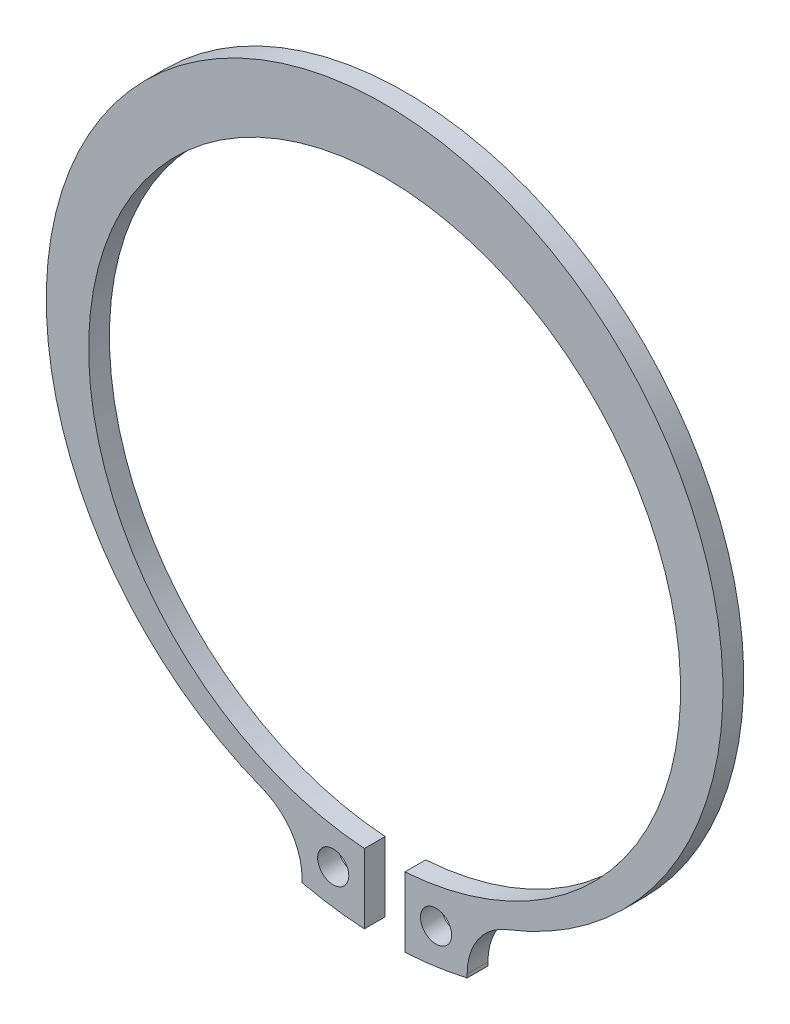
ISO-10303-21;
HEADER;
FILE_DESCRIPTION(('STEP AP214'),'2;1');
FILE_NAME('part.step','',(''),(''),'','','');
FILE_SCHEMA(('AUTOMOTIVE_DESIGN { 1 0 10303 214 1 1 1 1 }'));
ENDSEC;
DATA;
#1=APPLICATION_CONTEXT('core data for automotive mechanical design processes');
#2=APPLICATION_PROTOCOL_DEFINITION('international standard','automotive_design',2000,#1);
#3=PRODUCT_CONTEXT('',#1,'mechanical');
#4=PRODUCT('Part','Part','',(#3));
#5=PRODUCT_RELATED_PRODUCT_CATEGORY('part','',(#4));
#6=PRODUCT_DEFINITION_FORMATION('','',#4);
#7=PRODUCT_DEFINITION_CONTEXT('part definition',#1,'design');
#8=PRODUCT_DEFINITION('design','',#6,#7);
#9=PRODUCT_DEFINITION_SHAPE('','',#8);
#10=(LENGTH_UNIT() NAMED_UNIT(*) SI_UNIT(.MILLI.,.METRE.));
#11=(NAMED_UNIT(*) PLANE_ANGLE_UNIT() SI_UNIT($,.RADIAN.));
#12=(NAMED_UNIT(*) SI_UNIT($,.STERADIAN.) SOLID_ANGLE_UNIT());
#13=UNCERTAINTY_MEASURE_WITH_UNIT(LENGTH_MEASURE(1.E-05),#10,'distance_accuracy_value','');
#14=(GEOMETRIC_REPRESENTATION_CONTEXT(3) GLOBAL_UNCERTAINTY_ASSIGNED_CONTEXT((#13)) GLOBAL_UNIT_ASSIGNED_CONTEXT((#10,
#11,#12)) REPRESENTATION_CONTEXT('',''));
#15=CARTESIAN_POINT('',(0.,0.,0.));
#16=DIRECTION('',(0.,0.,1.));
#17=DIRECTION('',(1.,0.,0.));
#18=AXIS2_PLACEMENT_3D('',#15,#16,#17);
#19=CARTESIAN_POINT('',(9.90000000000002,-5.85070601970945,0.));
#20=DIRECTION('',(1.00000000000002,0.,0.));
#21=DIRECTION('',(0.,0.,-1.));
#22=AXIS2_PLACEMENT_3D('',#19,#20,#21);
#23=PLANE('',#22);
#24=DIRECTION('',(0.,0.,1.));
#25=VECTOR('',#24,1.);
#26=CARTESIAN_POINT('',(9.89999999998936,-5.85070601966375,0.));
#27=LINE('',#26,#25);
#28=CARTESIAN_POINT('',(9.89999999999469,-5.85070601966253,0.));
#29=VERTEX_POINT('',#28);
#30=CARTESIAN_POINT('',(9.89999999999469,-5.85070601966253,2.));
#31=VERTEX_POINT('',#30);
#32=EDGE_CURVE('E95',#29,#31,#27,.T.);
#33=ORIENTED_EDGE('',*,*,#32,.F.);
#34=DIRECTION('',(0.,1.00000000000002,0.));
#35=VECTOR('',#34,1.);
#36=CARTESIAN_POINT('',(9.90000000000002,4.44089209850063E-13,0.));
#37=LINE('',#36,#35);
#38=CARTESIAN_POINT('',(9.90000000000002,-5.49641347022945,0.));
#39=VERTEX_POINT('',#38);
#40=EDGE_CURVE('E98',#29,#39,#37,.T.);
#41=ORIENTED_EDGE('',*,*,#40,.T.);
#42=DIRECTION('',(0.,0.,1.));
#43=VECTOR('',#42,1.);
#44=CARTESIAN_POINT('',(9.90000000000002,-5.49641347022945,0.));
#45=LINE('',#44,#43);
#46=CARTESIAN_POINT('',(9.90000000000002,-5.49641347022945,2.));
#47=VERTEX_POINT('',#46);
#48=EDGE_CURVE('E118',#39,#47,#45,.T.);
#49=ORIENTED_EDGE('',*,*,#48,.T.);
#50=DIRECTION('',(0.,1.00000000000002,0.));
#51=VECTOR('',#50,1.);
#52=CARTESIAN_POINT('',(9.90000000000002,-5.85070601970945,2.));
#53=LINE('',#52,#51);
#54=EDGE_CURVE('E100',#47,#31,#53,.F.);
#55=ORIENTED_EDGE('',*,*,#54,.T.);
#56=EDGE_LOOP('',(#33,#41,#49,#55));
#57=FACE_BOUND('',#56,.T.);
#58=ADVANCED_FACE('F16',(#57),#23,.T.);
#59=CARTESIAN_POINT('',(-6.00000000000001,-5.49641347022953,0.));
#60=DIRECTION('',(-1.00000000000002,0.,0.));
#61=DIRECTION('',(0.,0.,1.));
#62=AXIS2_PLACEMENT_3D('',#59,#60,#61);
#63=PLANE('',#62);
#64=DIRECTION('',(0.,0.,1.));
#65=VECTOR('',#64,1.);
#66=CARTESIAN_POINT('',(-6.00000000000001,-5.49641347022953,0.));
#67=LINE('',#66,#65);
#68=CARTESIAN_POINT('',(-6.00000000000001,-5.49641347022953,2.));
#69=VERTEX_POINT('',#68);
#70=CARTESIAN_POINT('',(-6.00000000000001,-5.49641347022953,0.));
#71=VERTEX_POINT('',#70);
#72=EDGE_CURVE('E174',#69,#71,#67,.F.);
#73=ORIENTED_EDGE('',*,*,#72,.T.);
#74=DIRECTION('',(0.,1.00000000000002,0.));
#75=VECTOR('',#74,1.);
#76=CARTESIAN_POINT('',(-6.00000000000001,0.,0.));
#77=LINE('',#76,#75);
#78=CARTESIAN_POINT('',(-5.99999999999468,-5.85070601966261,0.));
#79=VERTEX_POINT('',#78);
#80=EDGE_CURVE('E114',#71,#79,#77,.F.);
#81=ORIENTED_EDGE('',*,*,#80,.T.);
#82=DIRECTION('',(0.,0.,1.));
#83=VECTOR('',#82,1.);
#84=CARTESIAN_POINT('',(-5.99999999998946,-5.85070601966383,0.));
#85=LINE('',#84,#83);
#86=CARTESIAN_POINT('',(-5.99999999999468,-5.85070601966261,2.));
#87=VERTEX_POINT('',#86);
#88=EDGE_CURVE('E161',#87,#79,#85,.F.);
#89=ORIENTED_EDGE('',*,*,#88,.F.);
#90=DIRECTION('',(0.,1.00000000000002,0.));
#91=VECTOR('',#90,1.);
#92=CARTESIAN_POINT('',(-6.00000000000001,-5.49641347022953,2.));
#93=LINE('',#92,#91);
#94=EDGE_CURVE('E115',#87,#69,#93,.T.);
#95=ORIENTED_EDGE('',*,*,#94,.T.);
#96=EDGE_LOOP('',(#73,#81,#89,#95));
#97=FACE_BOUND('',#96,.T.);
#98=ADVANCED_FACE('F210',(#97),#63,.T.);
#99=CARTESIAN_POINT('',(0.,0.,0.));
#100=DIRECTION('',(0.,0.,1.));
#101=DIRECTION('',(1.00000000000002,0.,0.));
#102=AXIS2_PLACEMENT_3D('',#99,#100,#101);
#103=PLANE('',#102);
#104=CARTESIAN_POINT('',(6.90000000000002,-3.02654355575956,0.));
#105=DIRECTION('',(0.,0.,-1.));
#106=DIRECTION('',(-1.00000000000002,0.,0.));
#107=AXIS2_PLACEMENT_3D('',#104,#105,#106);
#108=CIRCLE('',#107,1.5);
#109=CARTESIAN_POINT('',(5.39999999999998,-3.02654355575956,0.));
#110=VERTEX_POINT('',#109);
#111=EDGE_CURVE('E151',#110,#110,#108,.F.);
#112=ORIENTED_EDGE('',*,*,#111,.T.);
#113=EDGE_LOOP('',(#112));
#114=FACE_BOUND('',#113,.T.);
#115=CARTESIAN_POINT('',(-3.,-3.02654355576,0.));
#116=DIRECTION('',(0.,0.,1.));
#117=DIRECTION('',(1.00000000000002,0.,0.));
#118=AXIS2_PLACEMENT_3D('',#115,#116,#117);
#119=CIRCLE('',#118,1.5);
#120=CARTESIAN_POINT('',(-1.49999999999997,-3.02654355576,0.));
#121=VERTEX_POINT('',#120);
#122=EDGE_CURVE('E154',#121,#121,#119,.T.);
#123=ORIENTED_EDGE('',*,*,#122,.T.);
#124=EDGE_LOOP('',(#123));
#125=FACE_BOUND('',#124,.T.);
#126=CARTESIAN_POINT('',(1.95000000000001,28.4332112151011,0.));
#127=DIRECTION('',(0.,0.,1.));
#128=DIRECTION('',(1.00000000000002,0.,0.));
#129=AXIS2_PLACEMENT_3D('',#126,#127,#128);
#130=CIRCLE('',#129,35.1936);
#131=CARTESIAN_POINT('',(0.,-6.70632465208856,0.));
#132=VERTEX_POINT('',#131);
#133=EDGE_CURVE('E159',#79,#132,#130,.T.);
#134=ORIENTED_EDGE('',*,*,#133,.F.);
#135=ORIENTED_EDGE('',*,*,#80,.F.);
#136=CARTESIAN_POINT('',(-12.,-5.49641347022957,0.));
#137=DIRECTION('',(0.,0.,1.));
#138=DIRECTION('',(1.00000000000002,0.,0.));
#139=AXIS2_PLACEMENT_3D('',#136,#137,#138);
#140=CIRCLE('',#139,6.);
#141=CARTESIAN_POINT('',(-9.83048211508952,0.097618362630239,0.));
#142=VERTEX_POINT('',#141);
#143=EDGE_CURVE('E162',#71,#142,#140,.T.);
#144=ORIENTED_EDGE('',*,*,#143,.T.);
#145=CARTESIAN_POINT('',(1.95000000000001,30.4732112151011,0.));
#146=DIRECTION('',(0.,0.,1.));
#147=DIRECTION('',(1.00000000000002,0.,0.));
#148=AXIS2_PLACEMENT_3D('',#145,#146,#147);
#149=CIRCLE('',#148,32.58);
#150=CARTESIAN_POINT('',(13.7304821150858,0.0976183626536092,0.));
#151=VERTEX_POINT('',#150);
#152=EDGE_CURVE('E165',#151,#142,#149,.T.);
#153=ORIENTED_EDGE('',*,*,#152,.F.);
#154=CARTESIAN_POINT('',(15.9,-5.4964134702296,0.));
#155=DIRECTION('',(0.,0.,1.));
#156=DIRECTION('',(1.00000000000002,0.,0.));
#157=AXIS2_PLACEMENT_3D('',#154,#155,#156);
#158=CIRCLE('',#157,6.);
#159=EDGE_CURVE('E112',#151,#39,#158,.T.);
#160=ORIENTED_EDGE('',*,*,#159,.T.);
#161=ORIENTED_EDGE('',*,*,#40,.F.);
#162=CARTESIAN_POINT('',(1.95000000000001,28.4332112151011,0.));
#163=DIRECTION('',(0.,0.,1.));
#164=DIRECTION('',(1.00000000000002,0.,0.));
#165=AXIS2_PLACEMENT_3D('',#162,#163,#164);
#166=CIRCLE('',#165,35.1936);
#167=CARTESIAN_POINT('',(3.89999999999879,-6.70632465206772,0.));
#168=VERTEX_POINT('',#167);
#169=EDGE_CURVE('E19',#168,#29,#166,.T.);
#170=ORIENTED_EDGE('',*,*,#169,.F.);
#171=DIRECTION('',(0.,1.00000000000002,0.));
#172=VECTOR('',#171,1.);
#173=CARTESIAN_POINT('',(3.90000000000001,4.44089209850063E-13,0.));
#174=LINE('',#173,#172);
#175=CARTESIAN_POINT('',(3.89999999999846,4.41036096532343E-11,0.));
#176=VERTEX_POINT('',#175);
#177=EDGE_CURVE('E90',#176,#168,#174,.F.);
#178=ORIENTED_EDGE('',*,*,#177,.F.);
#179=CARTESIAN_POINT('',(1.95000000000001,28.4332112151011,0.));
#180=DIRECTION('',(0.,0.,1.));
#181=DIRECTION('',(1.00000000000002,0.,0.));
#182=AXIS2_PLACEMENT_3D('',#179,#180,#181);
#183=CIRCLE('',#182,28.5);
#184=CARTESIAN_POINT('',(1.4432899320127E-12,4.36595204433843E-11,0.));
#185=VERTEX_POINT('',#184);
#186=EDGE_CURVE('E126',#176,#185,#183,.T.);
#187=ORIENTED_EDGE('',*,*,#186,.T.);
#188=DIRECTION('',(0.,1.00000000000002,0.));
#189=VECTOR('',#188,1.);
#190=CARTESIAN_POINT('',(0.,-6.70632465210946,0.));
#191=LINE('',#190,#189);
#192=EDGE_CURVE('E124',#132,#185,#191,.T.);
#193=ORIENTED_EDGE('',*,*,#192,.F.);
#194=EDGE_LOOP('',(#134,#135,#144,#153,#160,#161,#170,#178,#187,#193));
#195=FACE_BOUND('',#194,.T.);
#196=ADVANCED_FACE('F109',(#114,#125,#195),#103,.F.);
#197=CARTESIAN_POINT('',(3.90000000000001,4.44089209850063E-13,0.));
#198=DIRECTION('',(-1.00000000000002,0.,0.));
#199=DIRECTION('',(0.,0.,1.));
#200=AXIS2_PLACEMENT_3D('',#197,#198,#199);
#201=PLANE('',#200);
#202=DIRECTION('',(0.,0.,1.));
#203=VECTOR('',#202,1.);
#204=CARTESIAN_POINT('',(3.89999999999702,4.39925873507718E-11,0.));
#205=LINE('',#204,#203);
#206=CARTESIAN_POINT('',(3.89999999999846,4.41036096532343E-11,2.));
#207=VERTEX_POINT('',#206);
#208=EDGE_CURVE('E157',#207,#176,#205,.F.);
#209=ORIENTED_EDGE('',*,*,#208,.T.);
#210=ORIENTED_EDGE('',*,*,#177,.T.);
#211=DIRECTION('',(0.,0.,1.));
#212=VECTOR('',#211,1.);
#213=CARTESIAN_POINT('',(3.89999999999768,-6.70632465206778,0.));
#214=LINE('',#213,#212);
#215=CARTESIAN_POINT('',(3.89999999999879,-6.70632465206772,2.));
#216=VERTEX_POINT('',#215);
#217=EDGE_CURVE('E105',#216,#168,#214,.F.);
#218=ORIENTED_EDGE('',*,*,#217,.F.);
#219=DIRECTION('',(0.,1.00000000000002,0.));
#220=VECTOR('',#219,1.);
#221=CARTESIAN_POINT('',(3.90000000000001,4.44089209850063E-13,2.));
#222=LINE('',#221,#220);
#223=EDGE_CURVE('E150',#207,#216,#222,.F.);
#224=ORIENTED_EDGE('',*,*,#223,.F.);
#225=EDGE_LOOP('',(#209,#210,#218,#224));
#226=FACE_BOUND('',#225,.T.);
#227=ADVANCED_FACE('F199',(#226),#201,.T.);
#228=CARTESIAN_POINT('',(1.95000000000001,28.4332112151011,0.));
#229=DIRECTION('',(0.,0.,1.));
#230=DIRECTION('',(1.00000000000002,0.,0.));
#231=AXIS2_PLACEMENT_3D('',#228,#229,#230);
#232=CYLINDRICAL_SURFACE('',#231,35.1936);
#233=ORIENTED_EDGE('',*,*,#217,.T.);
#234=ORIENTED_EDGE('',*,*,#169,.T.);
#235=ORIENTED_EDGE('',*,*,#32,.T.);
#236=CARTESIAN_POINT('',(1.95000000000001,28.4332112151011,2.));
#237=DIRECTION('',(0.,0.,1.));
#238=DIRECTION('',(1.00000000000002,0.,0.));
#239=AXIS2_PLACEMENT_3D('',#236,#237,#238);
#240=CIRCLE('',#239,35.1936);
#241=EDGE_CURVE('E148',#216,#31,#240,.T.);
#242=ORIENTED_EDGE('',*,*,#241,.F.);
#243=EDGE_LOOP('',(#233,#234,#235,#242));
#244=FACE_BOUND('',#243,.T.);
#245=ADVANCED_FACE('F117',(#244),#232,.T.);
#246=CARTESIAN_POINT('',(15.9,-5.4964134702296,0.));
#247=DIRECTION('',(0.,0.,1.));
#248=DIRECTION('',(1.00000000000002,0.,0.));
#249=AXIS2_PLACEMENT_3D('',#246,#247,#248);
#250=CYLINDRICAL_SURFACE('',#249,6.);
#251=CARTESIAN_POINT('',(15.9,-5.4964134702296,2.));
#252=DIRECTION('',(0.,0.,1.));
#253=DIRECTION('',(1.00000000000002,0.,0.));
#254=AXIS2_PLACEMENT_3D('',#251,#252,#253);
#255=CIRCLE('',#254,6.);
#256=CARTESIAN_POINT('',(13.7304821150775,0.097618362674759,2.));
#257=VERTEX_POINT('',#256);
#258=EDGE_CURVE('E145',#47,#257,#255,.F.);
#259=ORIENTED_EDGE('',*,*,#258,.F.);
#260=ORIENTED_EDGE('',*,*,#48,.F.);
#261=ORIENTED_EDGE('',*,*,#159,.F.);
#262=DIRECTION('',(0.,0.,1.));
#263=VECTOR('',#262,1.);
#264=CARTESIAN_POINT('',(13.7304821150833,0.0976183626770211,0.));
#265=LINE('',#264,#263);
#266=EDGE_CURVE('E167',#257,#151,#265,.F.);
#267=ORIENTED_EDGE('',*,*,#266,.F.);
#268=EDGE_LOOP('',(#259,#260,#261,#267));
#269=FACE_BOUND('',#268,.T.);
#270=ADVANCED_FACE('F202',(#269),#250,.F.);
#271=CARTESIAN_POINT('',(1.95000000000001,30.4732112151011,0.));
#272=DIRECTION('',(0.,0.,1.));
#273=DIRECTION('',(1.00000000000002,0.,0.));
#274=AXIS2_PLACEMENT_3D('',#271,#272,#273);
#275=CYLINDRICAL_SURFACE('',#274,32.58);
#276=ORIENTED_EDGE('',*,*,#266,.T.);
#277=ORIENTED_EDGE('',*,*,#152,.T.);
#278=DIRECTION('',(0.,0.,1.));
#279=VECTOR('',#278,1.);
#280=CARTESIAN_POINT('',(-9.83048211509108,0.0976183626308219,0.));
#281=LINE('',#280,#279);
#282=CARTESIAN_POINT('',(-9.83048211508952,0.097618362630239,2.));
#283=VERTEX_POINT('',#282);
#284=EDGE_CURVE('E164',#142,#283,#281,.T.);
#285=ORIENTED_EDGE('',*,*,#284,.T.);
#286=CARTESIAN_POINT('',(1.95000000000001,30.4732112151011,2.));
#287=DIRECTION('',(0.,0.,1.));
#288=DIRECTION('',(1.00000000000002,0.,0.));
#289=AXIS2_PLACEMENT_3D('',#286,#287,#288);
#290=CIRCLE('',#289,32.58);
#291=EDGE_CURVE('E142',#257,#283,#290,.T.);
#292=ORIENTED_EDGE('',*,*,#291,.F.);
#293=EDGE_LOOP('',(#276,#277,#285,#292));
#294=FACE_BOUND('',#293,.T.);
#295=ADVANCED_FACE('F203',(#294),#275,.T.);
#296=CARTESIAN_POINT('',(-12.,-5.49641347022957,0.));
#297=DIRECTION('',(0.,0.,1.));
#298=DIRECTION('',(1.00000000000002,0.,0.));
#299=AXIS2_PLACEMENT_3D('',#296,#297,#298);
#300=CYLINDRICAL_SURFACE('',#299,6.);
#301=CARTESIAN_POINT('',(-12.,-5.49641347022957,2.));
#302=DIRECTION('',(0.,0.,1.));
#303=DIRECTION('',(1.00000000000002,0.,0.));
#304=AXIS2_PLACEMENT_3D('',#301,#302,#303);
#305=CIRCLE('',#304,6.);
#306=EDGE_CURVE('E139',#283,#69,#305,.F.);
#307=ORIENTED_EDGE('',*,*,#306,.F.);
#308=ORIENTED_EDGE('',*,*,#284,.F.);
#309=ORIENTED_EDGE('',*,*,#143,.F.);
#310=ORIENTED_EDGE('',*,*,#72,.F.);
#311=EDGE_LOOP('',(#307,#308,#309,#310));
#312=FACE_BOUND('',#311,.T.);
#313=ADVANCED_FACE('F207',(#312),#300,.F.);
#314=CARTESIAN_POINT('',(1.95000000000001,28.4332112151011,0.));
#315=DIRECTION('',(0.,0.,1.));
#316=DIRECTION('',(1.00000000000002,0.,0.));
#317=AXIS2_PLACEMENT_3D('',#314,#315,#316);
#318=CYLINDRICAL_SURFACE('',#317,35.1936);
#319=ORIENTED_EDGE('',*,*,#88,.T.);
#320=ORIENTED_EDGE('',*,*,#133,.T.);
#321=DIRECTION('',(0.,0.,-1.));
#322=VECTOR('',#321,1.);
#323=CARTESIAN_POINT('',(0.,-6.70632465210946,0.));
#324=LINE('',#323,#322);
#325=CARTESIAN_POINT('',(0.,-6.70632465208856,2.));
#326=VERTEX_POINT('',#325);
#327=EDGE_CURVE('E127',#326,#132,#324,.T.);
#328=ORIENTED_EDGE('',*,*,#327,.F.);
#329=CARTESIAN_POINT('',(1.95000000000001,28.4332112151011,2.));
#330=DIRECTION('',(0.,0.,1.));
#331=DIRECTION('',(1.00000000000002,0.,0.));
#332=AXIS2_PLACEMENT_3D('',#329,#330,#331);
#333=CIRCLE('',#332,35.1936);
#334=EDGE_CURVE('E136',#87,#326,#333,.T.);
#335=ORIENTED_EDGE('',*,*,#334,.F.);
#336=EDGE_LOOP('',(#319,#320,#328,#335));
#337=FACE_BOUND('',#336,.T.);
#338=ADVANCED_FACE('F193',(#337),#318,.T.);
#339=CARTESIAN_POINT('',(0.,-6.70632465210946,0.));
#340=DIRECTION('',(1.00000000000002,0.,0.));
#341=DIRECTION('',(0.,0.,-1.));
#342=AXIS2_PLACEMENT_3D('',#339,#340,#341);
#343=PLANE('',#342);
#344=ORIENTED_EDGE('',*,*,#327,.T.);
#345=ORIENTED_EDGE('',*,*,#192,.T.);
#346=DIRECTION('',(0.,0.,1.));
#347=VECTOR('',#346,1.);
#348=CARTESIAN_POINT('',(2.99760216648792E-12,4.35484981409218E-11,0.));
#349=LINE('',#348,#347);
#350=CARTESIAN_POINT('',(1.4432899320127E-12,4.36595204433843E-11,2.));
#351=VERTEX_POINT('',#350);
#352=EDGE_CURVE('E34',#185,#351,#349,.T.);
#353=ORIENTED_EDGE('',*,*,#352,.T.);
#354=DIRECTION('',(0.,1.00000000000002,0.));
#355=VECTOR('',#354,1.);
#356=CARTESIAN_POINT('',(0.,0.,2.));
#357=LINE('',#356,#355);
#358=EDGE_CURVE('E135',#326,#351,#357,.T.);
#359=ORIENTED_EDGE('',*,*,#358,.F.);
#360=EDGE_LOOP('',(#344,#345,#353,#359));
#361=FACE_BOUND('',#360,.T.);
#362=ADVANCED_FACE('F190',(#361),#343,.T.);
#363=CARTESIAN_POINT('',(1.95000000000001,28.4332112151011,0.));
#364=DIRECTION('',(0.,0.,1.));
#365=DIRECTION('',(1.00000000000002,0.,0.));
#366=AXIS2_PLACEMENT_3D('',#363,#364,#365);
#367=CYLINDRICAL_SURFACE('',#366,28.5);
#368=CARTESIAN_POINT('',(1.95000000000001,28.4332112151011,2.));
#369=DIRECTION('',(0.,0.,1.));
#370=DIRECTION('',(1.00000000000002,0.,0.));
#371=AXIS2_PLACEMENT_3D('',#368,#369,#370);
#372=CIRCLE('',#371,28.5);
#373=EDGE_CURVE('E132',#351,#207,#372,.F.);
#374=ORIENTED_EDGE('',*,*,#373,.F.);
#375=ORIENTED_EDGE('',*,*,#352,.F.);
#376=ORIENTED_EDGE('',*,*,#186,.F.);
#377=ORIENTED_EDGE('',*,*,#208,.F.);
#378=EDGE_LOOP('',(#374,#375,#376,#377));
#379=FACE_BOUND('',#378,.T.);
#380=ADVANCED_FACE('F198',(#379),#367,.F.);
#381=CARTESIAN_POINT('',(-3.,-3.02654355576,2.));
#382=DIRECTION('',(0.,0.,1.));
#383=DIRECTION('',(1.00000000000002,0.,0.));
#384=AXIS2_PLACEMENT_3D('',#381,#382,#383);
#385=CYLINDRICAL_SURFACE('',#384,1.5);
#386=CARTESIAN_POINT('',(-3.,-3.02654355576,2.));
#387=DIRECTION('',(0.,0.,1.));
#388=DIRECTION('',(1.00000000000002,0.,0.));
#389=AXIS2_PLACEMENT_3D('',#386,#387,#388);
#390=CIRCLE('',#389,1.5);
#391=CARTESIAN_POINT('',(-1.49999999999997,-3.02654355576,2.));
#392=VERTEX_POINT('',#391);
#393=EDGE_CURVE('E25',#392,#392,#390,.F.);
#394=ORIENTED_EDGE('',*,*,#393,.F.);
#395=EDGE_LOOP('',(#394));
#396=FACE_BOUND('',#395,.T.);
#397=ORIENTED_EDGE('',*,*,#122,.F.);
#398=EDGE_LOOP('',(#397));
#399=FACE_BOUND('',#398,.T.);
#400=ADVANCED_FACE('F226',(#396,#399),#385,.F.);
#401=CARTESIAN_POINT('',(6.90000000000002,-3.02654355575956,2.));
#402=DIRECTION('',(0.,0.,-1.));
#403=DIRECTION('',(-1.00000000000002,0.,0.));
#404=AXIS2_PLACEMENT_3D('',#401,#402,#403);
#405=CYLINDRICAL_SURFACE('',#404,1.5);
#406=CARTESIAN_POINT('',(6.90000000000002,-3.02654355575956,2.));
#407=DIRECTION('',(0.,0.,-1.));
#408=DIRECTION('',(-1.00000000000002,0.,0.));
#409=AXIS2_PLACEMENT_3D('',#406,#407,#408);
#410=CIRCLE('',#409,1.5);
#411=CARTESIAN_POINT('',(5.39999999999998,-3.02654355575956,2.));
#412=VERTEX_POINT('',#411);
#413=EDGE_CURVE('E11',#412,#412,#410,.T.);
#414=ORIENTED_EDGE('',*,*,#413,.F.);
#415=EDGE_LOOP('',(#414));
#416=FACE_BOUND('',#415,.T.);
#417=ORIENTED_EDGE('',*,*,#111,.F.);
#418=EDGE_LOOP('',(#417));
#419=FACE_BOUND('',#418,.T.);
#420=ADVANCED_FACE('F220',(#416,#419),#405,.F.);
#421=CARTESIAN_POINT('',(0.,0.,2.));
#422=DIRECTION('',(0.,0.,1.));
#423=DIRECTION('',(1.00000000000002,0.,0.));
#424=AXIS2_PLACEMENT_3D('',#421,#422,#423);
#425=PLANE('',#424);
#426=ORIENTED_EDGE('',*,*,#413,.T.);
#427=EDGE_LOOP('',(#426));
#428=FACE_BOUND('',#427,.T.);
#429=ORIENTED_EDGE('',*,*,#393,.T.);
#430=EDGE_LOOP('',(#429));
#431=FACE_BOUND('',#430,.T.);
#432=ORIENTED_EDGE('',*,*,#358,.T.);
#433=ORIENTED_EDGE('',*,*,#373,.T.);
#434=ORIENTED_EDGE('',*,*,#223,.T.);
#435=ORIENTED_EDGE('',*,*,#241,.T.);
#436=ORIENTED_EDGE('',*,*,#54,.F.);
#437=ORIENTED_EDGE('',*,*,#258,.T.);
#438=ORIENTED_EDGE('',*,*,#291,.T.);
#439=ORIENTED_EDGE('',*,*,#306,.T.);
#440=ORIENTED_EDGE('',*,*,#94,.F.);
#441=ORIENTED_EDGE('',*,*,#334,.T.);
#442=EDGE_LOOP('',(#432,#433,#434,#435,#436,#437,#438,#439,#440,#441));
#443=FACE_BOUND('',#442,.T.);
#444=ADVANCED_FACE('F188',(#428,#431,#443),#425,.T.);
#445=CLOSED_SHELL('',(#58,#98,#196,#227,#245,#270,#295,#313,#338,#362,#380,#400,#420,#444));
#446=MANIFOLD_SOLID_BREP('B1',#445);
#447=ADVANCED_BREP_SHAPE_REPRESENTATION('',(#18,#446),#14);
#448=SHAPE_DEFINITION_REPRESENTATION(#9,#447);
ENDSEC;
END-ISO-10303-21;
